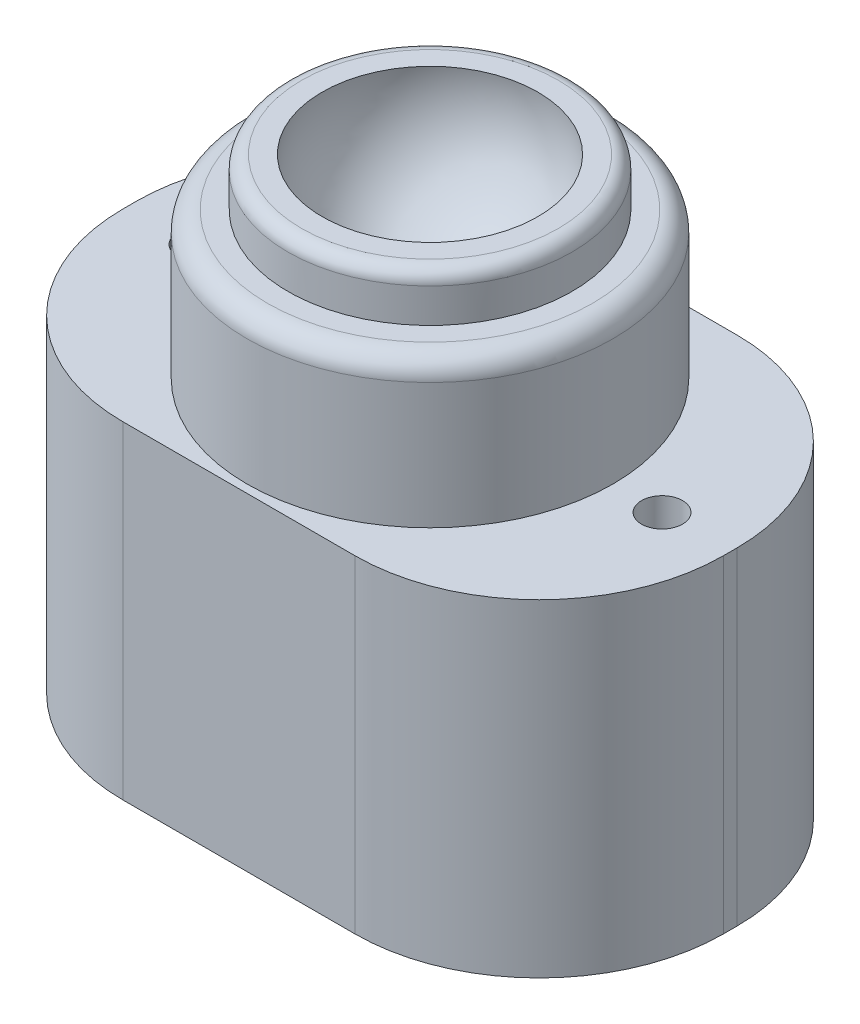
ISO-10303-21;
HEADER;
FILE_DESCRIPTION(('STEP AP214'),'2;1');
FILE_NAME('part.step','',(''),(''),'','','');
FILE_SCHEMA(('AUTOMOTIVE_DESIGN { 1 0 10303 214 1 1 1 1 }'));
ENDSEC;
DATA;
#1=APPLICATION_CONTEXT('core data for automotive mechanical design processes');
#2=APPLICATION_PROTOCOL_DEFINITION('international standard','automotive_design',2000,#1);
#3=PRODUCT_CONTEXT('',#1,'mechanical');
#4=PRODUCT('Part','Part','',(#3));
#5=PRODUCT_RELATED_PRODUCT_CATEGORY('part','',(#4));
#6=PRODUCT_DEFINITION_FORMATION('','',#4);
#7=PRODUCT_DEFINITION_CONTEXT('part definition',#1,'design');
#8=PRODUCT_DEFINITION('design','',#6,#7);
#9=PRODUCT_DEFINITION_SHAPE('','',#8);
#10=(LENGTH_UNIT() NAMED_UNIT(*) SI_UNIT(.MILLI.,.METRE.));
#11=(NAMED_UNIT(*) PLANE_ANGLE_UNIT() SI_UNIT($,.RADIAN.));
#12=(NAMED_UNIT(*) SI_UNIT($,.STERADIAN.) SOLID_ANGLE_UNIT());
#13=UNCERTAINTY_MEASURE_WITH_UNIT(LENGTH_MEASURE(1.E-05),#10,'distance_accuracy_value','');
#14=(GEOMETRIC_REPRESENTATION_CONTEXT(3) GLOBAL_UNCERTAINTY_ASSIGNED_CONTEXT((#13)) GLOBAL_UNIT_ASSIGNED_CONTEXT((#10,
#11,#12)) REPRESENTATION_CONTEXT('',''));
#15=CARTESIAN_POINT('',(0.,0.,0.));
#16=DIRECTION('',(0.,0.,1.));
#17=DIRECTION('',(1.,0.,0.));
#18=AXIS2_PLACEMENT_3D('',#15,#16,#17);
#19=CARTESIAN_POINT('',(0.,12.9999999996622,7.35212560189907E-05));
#20=DIRECTION('',(-1.,0.,0.));
#21=DIRECTION('',(0.,0.,-1.));
#22=AXIS2_PLACEMENT_3D('',#19,#20,#21);
#23=CIRCLE('',#22,8.);
#24=TRIMMED_CURVE('',#23,(PARAMETER_VALUE(-1.57078713663789)),
(PARAMETER_VALUE(1.57078713663789)),.T.,.PARAMETER.);
#25=CARTESIAN_POINT('',(0.,12.9999999996622,0.));
#26=DIRECTION('',(0.,-1.,0.));
#27=AXIS1_PLACEMENT('',#25,#26);
#28=SURFACE_OF_REVOLUTION('',#24,#27);
#29=CARTESIAN_POINT('',(0.,5.,0.));
#30=VERTEX_POINT('',#29);
#31=VERTEX_LOOP('',#30);
#32=FACE_BOUND('',#31,.T.);
#33=CARTESIAN_POINT('',(0.,14.2157146664998,0.));
#34=DIRECTION('',(0.,-1.,0.));
#35=DIRECTION('',(0.,0.,-1.));
#36=AXIS2_PLACEMENT_3D('',#33,#34,#35);
#37=CIRCLE('',#36,7.90701430226257);
#38=CARTESIAN_POINT('',(0.,14.2157146664998,-7.90701430226257));
#39=VERTEX_POINT('',#38);
#40=EDGE_CURVE('E113',#39,#39,#37,.T.);
#41=ORIENTED_EDGE('',*,*,#40,.F.);
#42=EDGE_LOOP('',(#41));
#43=FACE_BOUND('',#42,.T.);
#44=ADVANCED_FACE('F39',(#32,#43),#28,.F.);
#45=CARTESIAN_POINT('',(7.90701430226257,14.2157146664998,0.));
#46=DIRECTION('',(0.,1.,0.));
#47=DIRECTION('',(0.,0.,1.));
#48=AXIS2_PLACEMENT_3D('',#45,#46,#47);
#49=PLANE('',#48);
#50=CARTESIAN_POINT('',(0.,14.2157146664998,0.));
#51=DIRECTION('',(0.,1.,0.));
#52=DIRECTION('',(0.,0.,1.));
#53=AXIS2_PLACEMENT_3D('',#50,#51,#52);
#54=CIRCLE('',#53,9.40701430226257);
#55=CARTESIAN_POINT('',(0.,14.2157146664998,9.40701430226257));
#56=VERTEX_POINT('',#55);
#57=EDGE_CURVE('E122',#56,#56,#54,.T.);
#58=ORIENTED_EDGE('',*,*,#57,.T.);
#59=EDGE_LOOP('',(#58));
#60=FACE_BOUND('',#59,.T.);
#61=ORIENTED_EDGE('',*,*,#40,.T.);
#62=EDGE_LOOP('',(#61));
#63=FACE_BOUND('',#62,.T.);
#64=ADVANCED_FACE('F109',(#60,#63),#49,.T.);
#65=CARTESIAN_POINT('',(0.,0.,0.));
#66=DIRECTION('',(0.,-1.,0.));
#67=DIRECTION('',(0.,0.,-1.));
#68=AXIS2_PLACEMENT_3D('',#65,#66,#67);
#69=CYLINDRICAL_SURFACE('',#68,10.4070143022626);
#70=CARTESIAN_POINT('',(0.,13.2157146664998,0.));
#71=DIRECTION('',(0.,1.,0.));
#72=DIRECTION('',(0.,0.,1.));
#73=AXIS2_PLACEMENT_3D('',#70,#71,#72);
#74=CIRCLE('',#73,10.4070143022626);
#75=CARTESIAN_POINT('',(0.,13.2157146664998,10.4070143022626));
#76=VERTEX_POINT('',#75);
#77=EDGE_CURVE('E116',#76,#76,#74,.F.);
#78=ORIENTED_EDGE('',*,*,#77,.T.);
#79=EDGE_LOOP('',(#78));
#80=FACE_BOUND('',#79,.T.);
#81=CARTESIAN_POINT('',(0.,10.7157146664998,0.));
#82=DIRECTION('',(0.,-1.,0.));
#83=DIRECTION('',(0.,0.,-1.));
#84=AXIS2_PLACEMENT_3D('',#81,#82,#83);
#85=CIRCLE('',#84,10.4070143022626);
#86=CARTESIAN_POINT('',(0.,10.7157146664998,-10.4070143022626));
#87=VERTEX_POINT('',#86);
#88=EDGE_CURVE('E117',#87,#87,#85,.T.);
#89=ORIENTED_EDGE('',*,*,#88,.F.);
#90=EDGE_LOOP('',(#89));
#91=FACE_BOUND('',#90,.T.);
#92=ADVANCED_FACE('F302',(#80,#91),#69,.T.);
#93=CARTESIAN_POINT('',(10.4070143022626,10.7157146664998,0.));
#94=DIRECTION('',(0.,1.,0.));
#95=DIRECTION('',(0.,0.,1.));
#96=AXIS2_PLACEMENT_3D('',#93,#94,#95);
#97=PLANE('',#96);
#98=CARTESIAN_POINT('',(0.,10.7157146664998,0.));
#99=DIRECTION('',(0.,1.,0.));
#100=DIRECTION('',(0.,0.,1.));
#101=AXIS2_PLACEMENT_3D('',#98,#99,#100);
#102=CIRCLE('',#101,11.9070143022626);
#103=CARTESIAN_POINT('',(0.,10.7157146664998,11.9070143022626));
#104=VERTEX_POINT('',#103);
#105=EDGE_CURVE('E136',#104,#104,#102,.T.);
#106=ORIENTED_EDGE('',*,*,#105,.T.);
#107=EDGE_LOOP('',(#106));
#108=FACE_BOUND('',#107,.T.);
#109=ORIENTED_EDGE('',*,*,#88,.T.);
#110=EDGE_LOOP('',(#109));
#111=FACE_BOUND('',#110,.T.);
#112=ADVANCED_FACE('F306',(#108,#111),#97,.T.);
#113=CARTESIAN_POINT('',(0.,0.,0.));
#114=DIRECTION('',(0.,-1.,0.));
#115=DIRECTION('',(0.,0.,-1.));
#116=AXIS2_PLACEMENT_3D('',#113,#114,#115);
#117=CYLINDRICAL_SURFACE('',#116,13.4070143022626);
#118=CARTESIAN_POINT('',(0.,9.21571466649977,0.));
#119=DIRECTION('',(0.,1.,0.));
#120=DIRECTION('',(0.,0.,1.));
#121=AXIS2_PLACEMENT_3D('',#118,#119,#120);
#122=CIRCLE('',#121,13.4070143022626);
#123=CARTESIAN_POINT('',(0.,9.21571466649977,13.4070143022626));
#124=VERTEX_POINT('',#123);
#125=EDGE_CURVE('E132',#124,#124,#122,.F.);
#126=ORIENTED_EDGE('',*,*,#125,.T.);
#127=EDGE_LOOP('',(#126));
#128=FACE_BOUND('',#127,.T.);
#129=CARTESIAN_POINT('',(0.,0.,0.));
#130=DIRECTION('',(0.,-1.,0.));
#131=DIRECTION('',(0.,0.,-1.));
#132=AXIS2_PLACEMENT_3D('',#129,#130,#131);
#133=CIRCLE('',#132,13.4070143022626);
#134=CARTESIAN_POINT('',(0.,0.,-13.4070143022626));
#135=VERTEX_POINT('',#134);
#136=EDGE_CURVE('E125',#135,#135,#133,.T.);
#137=ORIENTED_EDGE('',*,*,#136,.F.);
#138=EDGE_LOOP('',(#137));
#139=FACE_BOUND('',#138,.T.);
#140=ADVANCED_FACE('F297',(#128,#139),#117,.T.);
#141=CARTESIAN_POINT('',(0.,13.2157146664998,0.));
#142=DIRECTION('',(0.,1.,0.));
#143=DIRECTION('',(0.,0.,1.));
#144=AXIS2_PLACEMENT_3D('',#141,#142,#143);
#145=TOROIDAL_SURFACE('',#144,9.40701430226257,1.);
#146=ORIENTED_EDGE('',*,*,#57,.F.);
#147=EDGE_LOOP('',(#146));
#148=FACE_BOUND('',#147,.T.);
#149=ORIENTED_EDGE('',*,*,#77,.F.);
#150=EDGE_LOOP('',(#149));
#151=FACE_BOUND('',#150,.T.);
#152=ADVANCED_FACE('F294',(#148,#151),#145,.T.);
#153=CARTESIAN_POINT('',(0.,9.21571466649977,0.));
#154=DIRECTION('',(0.,1.,0.));
#155=DIRECTION('',(0.,0.,1.));
#156=AXIS2_PLACEMENT_3D('',#153,#154,#155);
#157=TOROIDAL_SURFACE('',#156,11.9070143022626,1.5);
#158=ORIENTED_EDGE('',*,*,#105,.F.);
#159=EDGE_LOOP('',(#158));
#160=FACE_BOUND('',#159,.T.);
#161=ORIENTED_EDGE('',*,*,#125,.F.);
#162=EDGE_LOOP('',(#161));
#163=FACE_BOUND('',#162,.T.);
#164=ADVANCED_FACE('F291',(#160,#163),#157,.T.);
#165=CARTESIAN_POINT('',(-22.,-24.,14.));
#166=DIRECTION('',(-1.,0.,0.));
#167=DIRECTION('',(0.,0.,1.));
#168=AXIS2_PLACEMENT_3D('',#165,#166,#167);
#169=PLANE('',#168);
#170=DIRECTION('',(0.,0.,1.));
#171=VECTOR('',#170,1.);
#172=CARTESIAN_POINT('',(-22.,0.,14.));
#173=LINE('',#172,#171);
#174=CARTESIAN_POINT('',(-22.,0.,-0.499999999999994));
#175=VERTEX_POINT('',#174);
#176=CARTESIAN_POINT('',(-22.,0.,0.500000000000007));
#177=VERTEX_POINT('',#176);
#178=EDGE_CURVE('E190',#175,#177,#173,.T.);
#179=ORIENTED_EDGE('',*,*,#178,.F.);
#180=DIRECTION('',(0.,1.,0.));
#181=VECTOR('',#180,1.);
#182=CARTESIAN_POINT('',(-22.,-24.,-0.499999999999997));
#183=LINE('',#182,#181);
#184=CARTESIAN_POINT('',(-22.,-24.,-0.499999999999994));
#185=VERTEX_POINT('',#184);
#186=EDGE_CURVE('E11',#175,#185,#183,.F.);
#187=ORIENTED_EDGE('',*,*,#186,.T.);
#188=DIRECTION('',(0.,0.,1.));
#189=VECTOR('',#188,1.);
#190=CARTESIAN_POINT('',(-22.,-24.,14.));
#191=LINE('',#190,#189);
#192=CARTESIAN_POINT('',(-22.,-24.,0.500000000000007));
#193=VERTEX_POINT('',#192);
#194=EDGE_CURVE('E192',#185,#193,#191,.T.);
#195=ORIENTED_EDGE('',*,*,#194,.T.);
#196=DIRECTION('',(0.,1.,0.));
#197=VECTOR('',#196,1.);
#198=CARTESIAN_POINT('',(-22.,-24.,0.500000000000004));
#199=LINE('',#198,#197);
#200=EDGE_CURVE('E48',#193,#177,#199,.T.);
#201=ORIENTED_EDGE('',*,*,#200,.T.);
#202=EDGE_LOOP('',(#179,#187,#195,#201));
#203=FACE_BOUND('',#202,.T.);
#204=ADVANCED_FACE('F189',(#203),#169,.T.);
#205=CARTESIAN_POINT('',(22.,-24.,-14.));
#206=DIRECTION('',(0.,0.,-1.));
#207=DIRECTION('',(-1.,0.,0.));
#208=AXIS2_PLACEMENT_3D('',#205,#206,#207);
#209=PLANE('',#208);
#210=DIRECTION('',(-1.,0.,0.));
#211=VECTOR('',#210,1.);
#212=CARTESIAN_POINT('',(22.,0.,-14.));
#213=LINE('',#212,#211);
#214=CARTESIAN_POINT('',(8.49999999999999,0.,-14.));
#215=VERTEX_POINT('',#214);
#216=CARTESIAN_POINT('',(-8.5,0.,-14.));
#217=VERTEX_POINT('',#216);
#218=EDGE_CURVE('E218',#215,#217,#213,.T.);
#219=ORIENTED_EDGE('',*,*,#218,.F.);
#220=DIRECTION('',(0.,1.,0.));
#221=VECTOR('',#220,1.);
#222=CARTESIAN_POINT('',(8.49999999999999,-24.,-14.));
#223=LINE('',#222,#221);
#224=CARTESIAN_POINT('',(8.49999999999999,-24.,-14.));
#225=VERTEX_POINT('',#224);
#226=EDGE_CURVE('E62',#215,#225,#223,.F.);
#227=ORIENTED_EDGE('',*,*,#226,.T.);
#228=DIRECTION('',(-1.,0.,0.));
#229=VECTOR('',#228,1.);
#230=CARTESIAN_POINT('',(22.,-24.,-14.));
#231=LINE('',#230,#229);
#232=CARTESIAN_POINT('',(-8.5,-24.,-14.));
#233=VERTEX_POINT('',#232);
#234=EDGE_CURVE('E212',#225,#233,#231,.T.);
#235=ORIENTED_EDGE('',*,*,#234,.T.);
#236=DIRECTION('',(0.,1.,0.));
#237=VECTOR('',#236,1.);
#238=CARTESIAN_POINT('',(-8.5,-24.,-14.));
#239=LINE('',#238,#237);
#240=EDGE_CURVE('E177',#233,#217,#239,.T.);
#241=ORIENTED_EDGE('',*,*,#240,.T.);
#242=EDGE_LOOP('',(#219,#227,#235,#241));
#243=FACE_BOUND('',#242,.T.);
#244=ADVANCED_FACE('F273',(#243),#209,.T.);
#245=CARTESIAN_POINT('',(22.,-24.,14.));
#246=DIRECTION('',(1.,0.,0.));
#247=DIRECTION('',(0.,0.,-1.));
#248=AXIS2_PLACEMENT_3D('',#245,#246,#247);
#249=PLANE('',#248);
#250=DIRECTION('',(0.,0.,-1.));
#251=VECTOR('',#250,1.);
#252=CARTESIAN_POINT('',(22.,0.,14.));
#253=LINE('',#252,#251);
#254=CARTESIAN_POINT('',(22.,0.,0.5));
#255=VERTEX_POINT('',#254);
#256=CARTESIAN_POINT('',(22.,0.,-0.499999999999999));
#257=VERTEX_POINT('',#256);
#258=EDGE_CURVE('E206',#255,#257,#253,.T.);
#259=ORIENTED_EDGE('',*,*,#258,.F.);
#260=DIRECTION('',(0.,1.,0.));
#261=VECTOR('',#260,1.);
#262=CARTESIAN_POINT('',(22.,-24.,0.5));
#263=LINE('',#262,#261);
#264=CARTESIAN_POINT('',(22.,-24.,0.5));
#265=VERTEX_POINT('',#264);
#266=EDGE_CURVE('E163',#255,#265,#263,.F.);
#267=ORIENTED_EDGE('',*,*,#266,.T.);
#268=DIRECTION('',(0.,0.,-1.));
#269=VECTOR('',#268,1.);
#270=CARTESIAN_POINT('',(22.,-24.,14.));
#271=LINE('',#270,#269);
#272=CARTESIAN_POINT('',(22.,-24.,-0.499999999999999));
#273=VERTEX_POINT('',#272);
#274=EDGE_CURVE('E225',#265,#273,#271,.T.);
#275=ORIENTED_EDGE('',*,*,#274,.T.);
#276=DIRECTION('',(0.,1.,0.));
#277=VECTOR('',#276,1.);
#278=CARTESIAN_POINT('',(22.,-24.,-0.499999999999999));
#279=LINE('',#278,#277);
#280=EDGE_CURVE('E159',#273,#257,#279,.T.);
#281=ORIENTED_EDGE('',*,*,#280,.T.);
#282=EDGE_LOOP('',(#259,#267,#275,#281));
#283=FACE_BOUND('',#282,.T.);
#284=ADVANCED_FACE('F270',(#283),#249,.T.);
#285=CARTESIAN_POINT('',(22.,-24.,14.));
#286=DIRECTION('',(0.,0.,1.));
#287=DIRECTION('',(1.,0.,0.));
#288=AXIS2_PLACEMENT_3D('',#285,#286,#287);
#289=PLANE('',#288);
#290=DIRECTION('',(1.,0.,0.));
#291=VECTOR('',#290,1.);
#292=CARTESIAN_POINT('',(22.,-24.,14.));
#293=LINE('',#292,#291);
#294=CARTESIAN_POINT('',(-8.5,-24.,14.));
#295=VERTEX_POINT('',#294);
#296=CARTESIAN_POINT('',(8.5,-24.,14.));
#297=VERTEX_POINT('',#296);
#298=EDGE_CURVE('E229',#295,#297,#293,.T.);
#299=ORIENTED_EDGE('',*,*,#298,.T.);
#300=DIRECTION('',(0.,1.,0.));
#301=VECTOR('',#300,1.);
#302=CARTESIAN_POINT('',(8.5,-24.,14.));
#303=LINE('',#302,#301);
#304=CARTESIAN_POINT('',(8.5,0.,14.));
#305=VERTEX_POINT('',#304);
#306=EDGE_CURVE('E143',#297,#305,#303,.T.);
#307=ORIENTED_EDGE('',*,*,#306,.T.);
#308=DIRECTION('',(1.,0.,0.));
#309=VECTOR('',#308,1.);
#310=CARTESIAN_POINT('',(22.,0.,14.));
#311=LINE('',#310,#309);
#312=CARTESIAN_POINT('',(-8.5,0.,14.));
#313=VERTEX_POINT('',#312);
#314=EDGE_CURVE('E201',#313,#305,#311,.T.);
#315=ORIENTED_EDGE('',*,*,#314,.F.);
#316=DIRECTION('',(0.,1.,0.));
#317=VECTOR('',#316,1.);
#318=CARTESIAN_POINT('',(-8.5,-24.,14.));
#319=LINE('',#318,#317);
#320=EDGE_CURVE('E140',#313,#295,#319,.F.);
#321=ORIENTED_EDGE('',*,*,#320,.T.);
#322=EDGE_LOOP('',(#299,#307,#315,#321));
#323=FACE_BOUND('',#322,.T.);
#324=ADVANCED_FACE('F257',(#323),#289,.T.);
#325=CARTESIAN_POINT('',(0.,-24.,0.));
#326=DIRECTION('',(0.,1.,0.));
#327=DIRECTION('',(0.,0.,1.));
#328=AXIS2_PLACEMENT_3D('',#325,#326,#327);
#329=PLANE('',#328);
#330=CARTESIAN_POINT('',(17.,-24.,0.));
#331=DIRECTION('',(0.,-1.,0.));
#332=DIRECTION('',(0.,0.,1.));
#333=AXIS2_PLACEMENT_3D('',#330,#331,#332);
#334=CIRCLE('',#333,1.5);
#335=CARTESIAN_POINT('',(17.,-24.,1.5));
#336=VERTEX_POINT('',#335);
#337=EDGE_CURVE('E241',#336,#336,#334,.T.);
#338=ORIENTED_EDGE('',*,*,#337,.F.);
#339=EDGE_LOOP('',(#338));
#340=FACE_BOUND('',#339,.T.);
#341=CARTESIAN_POINT('',(-17.,-24.,0.));
#342=DIRECTION('',(0.,1.,0.));
#343=DIRECTION('',(0.,0.,1.));
#344=AXIS2_PLACEMENT_3D('',#341,#342,#343);
#345=CIRCLE('',#344,1.5);
#346=CARTESIAN_POINT('',(-17.,-24.,1.5));
#347=VERTEX_POINT('',#346);
#348=EDGE_CURVE('E202',#347,#347,#345,.T.);
#349=ORIENTED_EDGE('',*,*,#348,.T.);
#350=EDGE_LOOP('',(#349));
#351=FACE_BOUND('',#350,.T.);
#352=ORIENTED_EDGE('',*,*,#274,.F.);
#353=CARTESIAN_POINT('',(8.49999999999999,-24.,0.500000000000001));
#354=DIRECTION('',(0.,1.,0.));
#355=DIRECTION('',(0.,0.,1.));
#356=AXIS2_PLACEMENT_3D('',#353,#354,#355);
#357=CIRCLE('',#356,13.5);
#358=EDGE_CURVE('E174',#265,#297,#357,.F.);
#359=ORIENTED_EDGE('',*,*,#358,.T.);
#360=ORIENTED_EDGE('',*,*,#298,.F.);
#361=CARTESIAN_POINT('',(-8.5,-24.,0.500000000000004));
#362=DIRECTION('',(0.,1.,0.));
#363=DIRECTION('',(0.,0.,1.));
#364=AXIS2_PLACEMENT_3D('',#361,#362,#363);
#365=CIRCLE('',#364,13.5);
#366=EDGE_CURVE('E166',#295,#193,#365,.F.);
#367=ORIENTED_EDGE('',*,*,#366,.T.);
#368=ORIENTED_EDGE('',*,*,#194,.F.);
#369=CARTESIAN_POINT('',(-8.5,-24.,-0.499999999999996));
#370=DIRECTION('',(0.,1.,0.));
#371=DIRECTION('',(0.,0.,1.));
#372=AXIS2_PLACEMENT_3D('',#369,#370,#371);
#373=CIRCLE('',#372,13.5);
#374=EDGE_CURVE('E55',#185,#233,#373,.F.);
#375=ORIENTED_EDGE('',*,*,#374,.T.);
#376=ORIENTED_EDGE('',*,*,#234,.F.);
#377=CARTESIAN_POINT('',(8.49999999999999,-24.,-0.499999999999999));
#378=DIRECTION('',(0.,1.,0.));
#379=DIRECTION('',(0.,0.,1.));
#380=AXIS2_PLACEMENT_3D('',#377,#378,#379);
#381=CIRCLE('',#380,13.5);
#382=EDGE_CURVE('E171',#225,#273,#381,.F.);
#383=ORIENTED_EDGE('',*,*,#382,.T.);
#384=EDGE_LOOP('',(#352,#359,#360,#367,#368,#375,#376,#383));
#385=FACE_BOUND('',#384,.T.);
#386=ADVANCED_FACE('F254',(#340,#351,#385),#329,.F.);
#387=CARTESIAN_POINT('',(0.,0.,0.));
#388=DIRECTION('',(0.,1.,0.));
#389=DIRECTION('',(0.,0.,1.));
#390=AXIS2_PLACEMENT_3D('',#387,#388,#389);
#391=PLANE('',#390);
#392=CARTESIAN_POINT('',(17.,0.,0.));
#393=DIRECTION('',(0.,-1.,0.));
#394=DIRECTION('',(0.,0.,1.));
#395=AXIS2_PLACEMENT_3D('',#392,#393,#394);
#396=CIRCLE('',#395,1.5);
#397=CARTESIAN_POINT('',(17.,0.,1.5));
#398=VERTEX_POINT('',#397);
#399=EDGE_CURVE('E243',#398,#398,#396,.T.);
#400=ORIENTED_EDGE('',*,*,#399,.T.);
#401=EDGE_LOOP('',(#400));
#402=FACE_BOUND('',#401,.T.);
#403=CARTESIAN_POINT('',(-17.,0.,0.));
#404=DIRECTION('',(0.,1.,0.));
#405=DIRECTION('',(0.,0.,1.));
#406=AXIS2_PLACEMENT_3D('',#403,#404,#405);
#407=CIRCLE('',#406,1.5);
#408=CARTESIAN_POINT('',(-17.,0.,1.5));
#409=VERTEX_POINT('',#408);
#410=EDGE_CURVE('E209',#409,#409,#407,.T.);
#411=ORIENTED_EDGE('',*,*,#410,.F.);
#412=EDGE_LOOP('',(#411));
#413=FACE_BOUND('',#412,.T.);
#414=ORIENTED_EDGE('',*,*,#136,.T.);
#415=EDGE_LOOP('',(#414));
#416=FACE_BOUND('',#415,.T.);
#417=ORIENTED_EDGE('',*,*,#314,.T.);
#418=CARTESIAN_POINT('',(8.49999999999999,0.,0.500000000000001));
#419=DIRECTION('',(0.,1.,0.));
#420=DIRECTION('',(0.,0.,1.));
#421=AXIS2_PLACEMENT_3D('',#418,#419,#420);
#422=CIRCLE('',#421,13.5);
#423=EDGE_CURVE('E156',#305,#255,#422,.T.);
#424=ORIENTED_EDGE('',*,*,#423,.T.);
#425=ORIENTED_EDGE('',*,*,#258,.T.);
#426=CARTESIAN_POINT('',(8.49999999999999,0.,-0.499999999999999));
#427=DIRECTION('',(0.,1.,0.));
#428=DIRECTION('',(0.,0.,1.));
#429=AXIS2_PLACEMENT_3D('',#426,#427,#428);
#430=CIRCLE('',#429,13.5);
#431=EDGE_CURVE('E153',#257,#215,#430,.T.);
#432=ORIENTED_EDGE('',*,*,#431,.T.);
#433=ORIENTED_EDGE('',*,*,#218,.T.);
#434=CARTESIAN_POINT('',(-8.5,0.,-0.499999999999996));
#435=DIRECTION('',(0.,1.,0.));
#436=DIRECTION('',(0.,0.,1.));
#437=AXIS2_PLACEMENT_3D('',#434,#435,#436);
#438=CIRCLE('',#437,13.5);
#439=EDGE_CURVE('E150',#217,#175,#438,.T.);
#440=ORIENTED_EDGE('',*,*,#439,.T.);
#441=ORIENTED_EDGE('',*,*,#178,.T.);
#442=CARTESIAN_POINT('',(-8.5,0.,0.500000000000004));
#443=DIRECTION('',(0.,1.,0.));
#444=DIRECTION('',(0.,0.,1.));
#445=AXIS2_PLACEMENT_3D('',#442,#443,#444);
#446=CIRCLE('',#445,13.5);
#447=EDGE_CURVE('E147',#177,#313,#446,.T.);
#448=ORIENTED_EDGE('',*,*,#447,.T.);
#449=EDGE_LOOP('',(#417,#424,#425,#432,#433,#440,#441,#448));
#450=FACE_BOUND('',#449,.T.);
#451=ADVANCED_FACE('F197',(#402,#413,#416,#450),#391,.T.);
#452=CARTESIAN_POINT('',(8.49999999999999,-24.,0.500000000000001));
#453=DIRECTION('',(0.,1.,0.));
#454=DIRECTION('',(0.,0.,1.));
#455=AXIS2_PLACEMENT_3D('',#452,#453,#454);
#456=CYLINDRICAL_SURFACE('',#455,13.5);
#457=ORIENTED_EDGE('',*,*,#358,.F.);
#458=ORIENTED_EDGE('',*,*,#266,.F.);
#459=ORIENTED_EDGE('',*,*,#423,.F.);
#460=ORIENTED_EDGE('',*,*,#306,.F.);
#461=EDGE_LOOP('',(#457,#458,#459,#460));
#462=FACE_BOUND('',#461,.T.);
#463=ADVANCED_FACE('F266',(#462),#456,.T.);
#464=CARTESIAN_POINT('',(8.49999999999999,-24.,-0.499999999999999));
#465=DIRECTION('',(0.,1.,0.));
#466=DIRECTION('',(0.,0.,1.));
#467=AXIS2_PLACEMENT_3D('',#464,#465,#466);
#468=CYLINDRICAL_SURFACE('',#467,13.5);
#469=ORIENTED_EDGE('',*,*,#382,.F.);
#470=ORIENTED_EDGE('',*,*,#226,.F.);
#471=ORIENTED_EDGE('',*,*,#431,.F.);
#472=ORIENTED_EDGE('',*,*,#280,.F.);
#473=EDGE_LOOP('',(#469,#470,#471,#472));
#474=FACE_BOUND('',#473,.T.);
#475=ADVANCED_FACE('F272',(#474),#468,.T.);
#476=CARTESIAN_POINT('',(-8.5,-24.,-0.499999999999996));
#477=DIRECTION('',(0.,1.,0.));
#478=DIRECTION('',(0.,0.,1.));
#479=AXIS2_PLACEMENT_3D('',#476,#477,#478);
#480=CYLINDRICAL_SURFACE('',#479,13.5);
#481=ORIENTED_EDGE('',*,*,#374,.F.);
#482=ORIENTED_EDGE('',*,*,#186,.F.);
#483=ORIENTED_EDGE('',*,*,#439,.F.);
#484=ORIENTED_EDGE('',*,*,#240,.F.);
#485=EDGE_LOOP('',(#481,#482,#483,#484));
#486=FACE_BOUND('',#485,.T.);
#487=ADVANCED_FACE('F275',(#486),#480,.T.);
#488=CARTESIAN_POINT('',(-8.5,-24.,0.500000000000004));
#489=DIRECTION('',(0.,1.,0.));
#490=DIRECTION('',(0.,0.,1.));
#491=AXIS2_PLACEMENT_3D('',#488,#489,#490);
#492=CYLINDRICAL_SURFACE('',#491,13.5);
#493=ORIENTED_EDGE('',*,*,#366,.F.);
#494=ORIENTED_EDGE('',*,*,#320,.F.);
#495=ORIENTED_EDGE('',*,*,#447,.F.);
#496=ORIENTED_EDGE('',*,*,#200,.F.);
#497=EDGE_LOOP('',(#493,#494,#495,#496));
#498=FACE_BOUND('',#497,.T.);
#499=ADVANCED_FACE('F41',(#498),#492,.T.);
#500=CARTESIAN_POINT('',(-17.,-24.,0.));
#501=DIRECTION('',(0.,1.,0.));
#502=DIRECTION('',(0.,0.,1.));
#503=AXIS2_PLACEMENT_3D('',#500,#501,#502);
#504=CYLINDRICAL_SURFACE('',#503,1.5);
#505=ORIENTED_EDGE('',*,*,#348,.F.);
#506=EDGE_LOOP('',(#505));
#507=FACE_BOUND('',#506,.T.);
#508=ORIENTED_EDGE('',*,*,#410,.T.);
#509=EDGE_LOOP('',(#508));
#510=FACE_BOUND('',#509,.T.);
#511=ADVANCED_FACE('F277',(#507,#510),#504,.F.);
#512=CARTESIAN_POINT('',(17.,-24.,0.));
#513=DIRECTION('',(0.,1.,0.));
#514=DIRECTION('',(0.,0.,1.));
#515=AXIS2_PLACEMENT_3D('',#512,#513,#514);
#516=CYLINDRICAL_SURFACE('',#515,1.5);
#517=ORIENTED_EDGE('',*,*,#337,.T.);
#518=EDGE_LOOP('',(#517));
#519=FACE_BOUND('',#518,.T.);
#520=ORIENTED_EDGE('',*,*,#399,.F.);
#521=EDGE_LOOP('',(#520));
#522=FACE_BOUND('',#521,.T.);
#523=ADVANCED_FACE('F251',(#519,#522),#516,.F.);
#524=CLOSED_SHELL('',(#44,#64,#92,#112,#140,#152,#164,#204,#244,#284,#324,#386,#451,#463,#475,
#487,#499,#511,#523));
#525=MANIFOLD_SOLID_BREP('B2',#524);
#526=ADVANCED_BREP_SHAPE_REPRESENTATION('',(#18,#525),#14);
#527=SHAPE_DEFINITION_REPRESENTATION(#9,#526);
ENDSEC;
END-ISO-10303-21;
